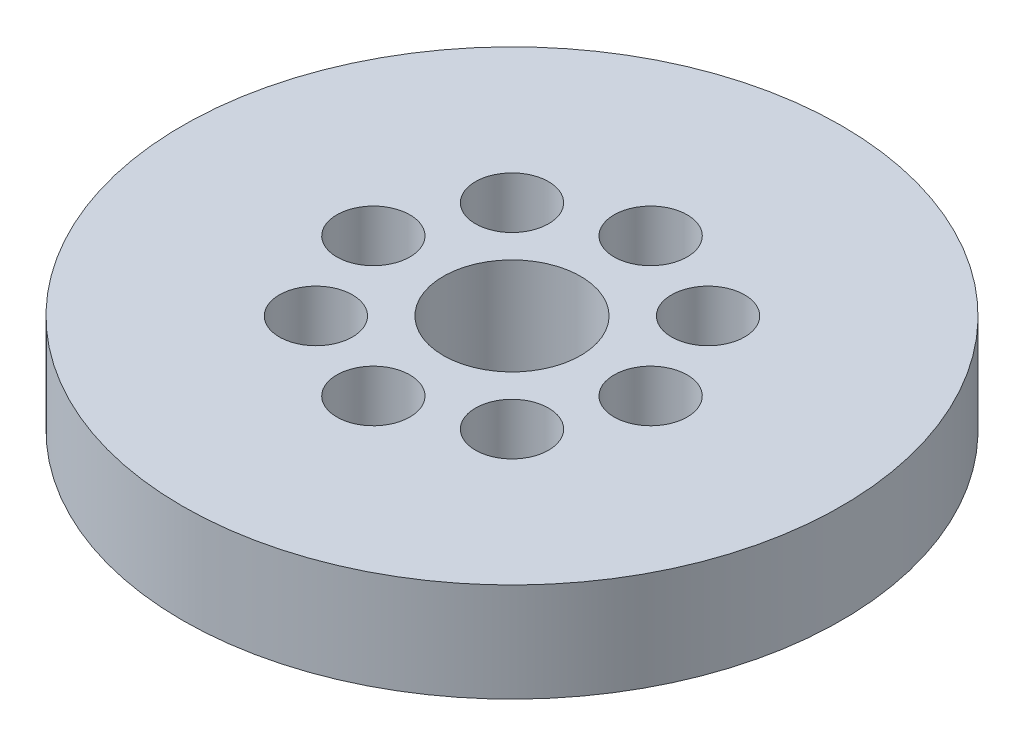
ISO-10303-21;
HEADER;
FILE_DESCRIPTION(('STEP AP214'),'2;1');
FILE_NAME('part.step','',(''),(''),'','','');
FILE_SCHEMA(('AUTOMOTIVE_DESIGN { 1 0 10303 214 1 1 1 1 }'));
ENDSEC;
DATA;
#1=APPLICATION_CONTEXT('core data for automotive mechanical design processes');
#2=APPLICATION_PROTOCOL_DEFINITION('international standard','automotive_design',2000,#1);
#3=PRODUCT_CONTEXT('',#1,'mechanical');
#4=PRODUCT('Part','Part','',(#3));
#5=PRODUCT_RELATED_PRODUCT_CATEGORY('part','',(#4));
#6=PRODUCT_DEFINITION_FORMATION('','',#4);
#7=PRODUCT_DEFINITION_CONTEXT('part definition',#1,'design');
#8=PRODUCT_DEFINITION('design','',#6,#7);
#9=PRODUCT_DEFINITION_SHAPE('','',#8);
#10=(LENGTH_UNIT() NAMED_UNIT(*) SI_UNIT(.MILLI.,.METRE.));
#11=(NAMED_UNIT(*) PLANE_ANGLE_UNIT() SI_UNIT($,.RADIAN.));
#12=(NAMED_UNIT(*) SI_UNIT($,.STERADIAN.) SOLID_ANGLE_UNIT());
#13=UNCERTAINTY_MEASURE_WITH_UNIT(LENGTH_MEASURE(1.E-05),#10,'distance_accuracy_value','');
#14=(GEOMETRIC_REPRESENTATION_CONTEXT(3) GLOBAL_UNCERTAINTY_ASSIGNED_CONTEXT((#13)) GLOBAL_UNIT_ASSIGNED_CONTEXT((#10,
#11,#12)) REPRESENTATION_CONTEXT('',''));
#15=CARTESIAN_POINT('',(0.,0.,0.));
#16=DIRECTION('',(0.,0.,1.));
#17=DIRECTION('',(1.,0.,0.));
#18=AXIS2_PLACEMENT_3D('',#15,#16,#17);
#19=CARTESIAN_POINT('',(0.,18.,0.));
#20=DIRECTION('',(0.,-1.,0.));
#21=DIRECTION('',(0.,0.,-1.));
#22=AXIS2_PLACEMENT_3D('',#19,#20,#21);
#23=CYLINDRICAL_SURFACE('',#22,60.);
#24=CARTESIAN_POINT('',(0.,18.,0.));
#25=DIRECTION('',(0.,1.,0.));
#26=DIRECTION('',(0.,0.,1.));
#27=AXIS2_PLACEMENT_3D('',#24,#25,#26);
#28=CIRCLE('',#27,60.);
#29=CARTESIAN_POINT('',(0.,18.,60.));
#30=VERTEX_POINT('',#29);
#31=EDGE_CURVE('E10',#30,#30,#28,.T.);
#32=ORIENTED_EDGE('',*,*,#31,.F.);
#33=EDGE_LOOP('',(#32));
#34=FACE_BOUND('',#33,.T.);
#35=CARTESIAN_POINT('',(0.,0.,0.));
#36=DIRECTION('',(0.,1.,0.));
#37=DIRECTION('',(0.,0.,1.));
#38=AXIS2_PLACEMENT_3D('',#35,#36,#37);
#39=CIRCLE('',#38,60.);
#40=CARTESIAN_POINT('',(0.,0.,60.));
#41=VERTEX_POINT('',#40);
#42=EDGE_CURVE('E37',#41,#41,#39,.T.);
#43=ORIENTED_EDGE('',*,*,#42,.T.);
#44=EDGE_LOOP('',(#43));
#45=FACE_BOUND('',#44,.T.);
#46=ADVANCED_FACE('F40',(#34,#45),#23,.T.);
#47=CARTESIAN_POINT('',(0.,18.,0.));
#48=DIRECTION('',(0.,1.,0.));
#49=DIRECTION('',(0.,0.,1.));
#50=AXIS2_PLACEMENT_3D('',#47,#48,#49);
#51=PLANE('',#50);
#52=CARTESIAN_POINT('',(0.,18.,25.2421052758937));
#53=DIRECTION('',(0.,1.,0.));
#54=DIRECTION('',(1.,0.,0.));
#55=AXIS2_PLACEMENT_3D('',#52,#53,#54);
#56=CIRCLE('',#55,6.65409280349945);
#57=CARTESIAN_POINT('',(6.65409280349954,18.,25.2421052758937));
#58=VERTEX_POINT('',#57);
#59=EDGE_CURVE('E88',#58,#58,#56,.T.);
#60=ORIENTED_EDGE('',*,*,#59,.F.);
#61=EDGE_LOOP('',(#60));
#62=FACE_BOUND('',#61,.T.);
#63=CARTESIAN_POINT('',(17.8488638120093,18.,17.8488638120091));
#64=DIRECTION('',(0.,1.,0.));
#65=DIRECTION('',(0.707106781186544,0.,-0.707106781186551));
#66=AXIS2_PLACEMENT_3D('',#63,#64,#65);
#67=CIRCLE('',#66,6.65409280349945);
#68=CARTESIAN_POINT('',(22.5540179560083,18.,13.14370966801));
#69=VERTEX_POINT('',#68);
#70=EDGE_CURVE('E79',#69,#69,#67,.T.);
#71=ORIENTED_EDGE('',*,*,#70,.F.);
#72=EDGE_LOOP('',(#71));
#73=FACE_BOUND('',#72,.T.);
#74=CARTESIAN_POINT('',(25.2421052758937,18.,0.));
#75=DIRECTION('',(0.,1.,0.));
#76=DIRECTION('',(0.,0.,-1.));
#77=AXIS2_PLACEMENT_3D('',#74,#75,#76);
#78=CIRCLE('',#77,6.65409280349945);
#79=CARTESIAN_POINT('',(25.2421052758937,18.,-6.65409280349945));
#80=VERTEX_POINT('',#79);
#81=EDGE_CURVE('E74',#80,#80,#78,.T.);
#82=ORIENTED_EDGE('',*,*,#81,.F.);
#83=EDGE_LOOP('',(#82));
#84=FACE_BOUND('',#83,.T.);
#85=CARTESIAN_POINT('',(17.848863812009,18.,-17.8488638120093));
#86=DIRECTION('',(0.,1.,0.));
#87=DIRECTION('',(-0.707106781186554,0.,-0.707106781186541));
#88=AXIS2_PLACEMENT_3D('',#85,#86,#87);
#89=CIRCLE('',#88,6.65409280349945);
#90=CARTESIAN_POINT('',(13.1437096680099,18.,-22.5540179560084));
#91=VERTEX_POINT('',#90);
#92=EDGE_CURVE('E70',#91,#91,#89,.T.);
#93=ORIENTED_EDGE('',*,*,#92,.F.);
#94=EDGE_LOOP('',(#93));
#95=FACE_BOUND('',#94,.T.);
#96=CARTESIAN_POINT('',(-2.6439701857169E-13,18.,-25.2421052758937));
#97=DIRECTION('',(0.,1.,0.));
#98=DIRECTION('',(-1.,0.,0.));
#99=AXIS2_PLACEMENT_3D('',#96,#97,#98);
#100=CIRCLE('',#99,6.65409280349945);
#101=CARTESIAN_POINT('',(-6.65409280349971,18.,-25.2421052758937));
#102=VERTEX_POINT('',#101);
#103=EDGE_CURVE('E100',#102,#102,#100,.T.);
#104=ORIENTED_EDGE('',*,*,#103,.F.);
#105=EDGE_LOOP('',(#104));
#106=FACE_BOUND('',#105,.T.);
#107=CARTESIAN_POINT('',(-17.8488638120094,18.,-17.848863812009));
#108=DIRECTION('',(0.,1.,0.));
#109=DIRECTION('',(-0.707106781186539,0.,0.707106781186556));
#110=AXIS2_PLACEMENT_3D('',#107,#108,#109);
#111=CIRCLE('',#110,6.65409280349945);
#112=CARTESIAN_POINT('',(-22.5540179560084,18.,-13.1437096680098));
#113=VERTEX_POINT('',#112);
#114=EDGE_CURVE('E93',#113,#113,#111,.T.);
#115=ORIENTED_EDGE('',*,*,#114,.F.);
#116=EDGE_LOOP('',(#115));
#117=FACE_BOUND('',#116,.T.);
#118=CARTESIAN_POINT('',(-17.8488638120091,18.,17.8488638120092));
#119=DIRECTION('',(0.,1.,0.));
#120=DIRECTION('',(0.707106781186549,0.,0.707106781186546));
#121=AXIS2_PLACEMENT_3D('',#118,#119,#120);
#122=CIRCLE('',#121,6.65409280349945);
#123=CARTESIAN_POINT('',(-13.1437096680101,18.,22.5540179560083));
#124=VERTEX_POINT('',#123);
#125=EDGE_CURVE('E61',#124,#124,#122,.T.);
#126=ORIENTED_EDGE('',*,*,#125,.F.);
#127=EDGE_LOOP('',(#126));
#128=FACE_BOUND('',#127,.T.);
#129=CARTESIAN_POINT('',(-25.2421052758937,18.,0.));
#130=DIRECTION('',(0.,1.,0.));
#131=DIRECTION('',(0.,0.,1.));
#132=AXIS2_PLACEMENT_3D('',#129,#130,#131);
#133=CIRCLE('',#132,6.65409280349945);
#134=CARTESIAN_POINT('',(-25.2421052758937,18.,6.65409280349945));
#135=VERTEX_POINT('',#134);
#136=EDGE_CURVE('E54',#135,#135,#133,.T.);
#137=ORIENTED_EDGE('',*,*,#136,.F.);
#138=EDGE_LOOP('',(#137));
#139=FACE_BOUND('',#138,.T.);
#140=CARTESIAN_POINT('',(0.,18.,0.));
#141=DIRECTION('',(0.,1.,0.));
#142=DIRECTION('',(0.,0.,1.));
#143=AXIS2_PLACEMENT_3D('',#140,#141,#142);
#144=CIRCLE('',#143,12.5);
#145=CARTESIAN_POINT('',(0.,18.,12.5));
#146=VERTEX_POINT('',#145);
#147=EDGE_CURVE('E50',#146,#146,#144,.T.);
#148=ORIENTED_EDGE('',*,*,#147,.F.);
#149=EDGE_LOOP('',(#148));
#150=FACE_BOUND('',#149,.T.);
#151=ORIENTED_EDGE('',*,*,#31,.T.);
#152=EDGE_LOOP('',(#151));
#153=FACE_BOUND('',#152,.T.);
#154=ADVANCED_FACE('F115',(#62,#73,#84,#95,#106,#117,#128,#139,#150,#153),#51,.T.);
#155=CARTESIAN_POINT('',(0.,0.,0.));
#156=DIRECTION('',(0.,1.,0.));
#157=DIRECTION('',(0.,0.,1.));
#158=AXIS2_PLACEMENT_3D('',#155,#156,#157);
#159=PLANE('',#158);
#160=CARTESIAN_POINT('',(0.,0.,0.));
#161=DIRECTION('',(0.,1.,0.));
#162=DIRECTION('',(0.,0.,1.));
#163=AXIS2_PLACEMENT_3D('',#160,#161,#162);
#164=CIRCLE('',#163,12.5);
#165=CARTESIAN_POINT('',(0.,0.,12.5));
#166=VERTEX_POINT('',#165);
#167=EDGE_CURVE('E47',#166,#166,#164,.T.);
#168=ORIENTED_EDGE('',*,*,#167,.T.);
#169=EDGE_LOOP('',(#168));
#170=FACE_BOUND('',#169,.T.);
#171=ORIENTED_EDGE('',*,*,#42,.F.);
#172=EDGE_LOOP('',(#171));
#173=FACE_BOUND('',#172,.T.);
#174=ADVANCED_FACE('F113',(#170,#173),#159,.F.);
#175=CARTESIAN_POINT('',(0.,18.,0.));
#176=DIRECTION('',(0.,-1.,0.));
#177=DIRECTION('',(0.,0.,-1.));
#178=AXIS2_PLACEMENT_3D('',#175,#176,#177);
#179=CYLINDRICAL_SURFACE('',#178,12.5);
#180=ORIENTED_EDGE('',*,*,#147,.T.);
#181=EDGE_LOOP('',(#180));
#182=FACE_BOUND('',#181,.T.);
#183=ORIENTED_EDGE('',*,*,#167,.F.);
#184=EDGE_LOOP('',(#183));
#185=FACE_BOUND('',#184,.T.);
#186=ADVANCED_FACE('F127',(#182,#185),#179,.F.);
#187=CARTESIAN_POINT('',(-25.2421052758937,5.5198192491017,0.));
#188=DIRECTION('',(0.,1.,0.));
#189=DIRECTION('',(0.,0.,1.));
#190=AXIS2_PLACEMENT_3D('',#187,#188,#189);
#191=CYLINDRICAL_SURFACE('',#190,6.65409280349945);
#192=CARTESIAN_POINT('',(-25.2421052758937,5.5198192491017,0.));
#193=DIRECTION('',(0.,1.,0.));
#194=DIRECTION('',(0.,0.,1.));
#195=AXIS2_PLACEMENT_3D('',#192,#193,#194);
#196=CIRCLE('',#195,6.65409280349945);
#197=CARTESIAN_POINT('',(-25.2421052758937,5.5198192491017,6.65409280349945));
#198=VERTEX_POINT('',#197);
#199=EDGE_CURVE('E55',#198,#198,#196,.T.);
#200=ORIENTED_EDGE('',*,*,#199,.F.);
#201=EDGE_LOOP('',(#200));
#202=FACE_BOUND('',#201,.T.);
#203=ORIENTED_EDGE('',*,*,#136,.T.);
#204=EDGE_LOOP('',(#203));
#205=FACE_BOUND('',#204,.T.);
#206=ADVANCED_FACE('F129',(#202,#205),#191,.F.);
#207=CARTESIAN_POINT('',(-25.2421052758937,5.5198192491017,0.));
#208=DIRECTION('',(0.,1.,0.));
#209=DIRECTION('',(0.,0.,1.));
#210=AXIS2_PLACEMENT_3D('',#207,#208,#209);
#211=PLANE('',#210);
#212=ORIENTED_EDGE('',*,*,#199,.T.);
#213=EDGE_LOOP('',(#212));
#214=FACE_BOUND('',#213,.T.);
#215=ADVANCED_FACE('F157',(#214),#211,.T.);
#216=CARTESIAN_POINT('',(-17.8488638120091,5.5198192491017,17.8488638120092));
#217=DIRECTION('',(0.,1.,0.));
#218=DIRECTION('',(0.,0.,1.));
#219=AXIS2_PLACEMENT_3D('',#216,#217,#218);
#220=CYLINDRICAL_SURFACE('',#219,6.65409280349945);
#221=CARTESIAN_POINT('',(-17.8488638120091,5.5198192491017,17.8488638120092));
#222=DIRECTION('',(0.,1.,0.));
#223=DIRECTION('',(0.707106781186549,0.,0.707106781186546));
#224=AXIS2_PLACEMENT_3D('',#221,#222,#223);
#225=CIRCLE('',#224,6.65409280349945);
#226=CARTESIAN_POINT('',(-13.1437096680101,5.5198192491017,22.5540179560083));
#227=VERTEX_POINT('',#226);
#228=EDGE_CURVE('E59',#227,#227,#225,.T.);
#229=ORIENTED_EDGE('',*,*,#228,.F.);
#230=EDGE_LOOP('',(#229));
#231=FACE_BOUND('',#230,.T.);
#232=ORIENTED_EDGE('',*,*,#125,.T.);
#233=EDGE_LOOP('',(#232));
#234=FACE_BOUND('',#233,.T.);
#235=ADVANCED_FACE('F170',(#231,#234),#220,.F.);
#236=CARTESIAN_POINT('',(-17.8488638120091,5.5198192491017,17.8488638120092));
#237=DIRECTION('',(0.,1.,0.));
#238=DIRECTION('',(0.707106781186549,0.,0.707106781186546));
#239=AXIS2_PLACEMENT_3D('',#236,#237,#238);
#240=PLANE('',#239);
#241=ORIENTED_EDGE('',*,*,#228,.T.);
#242=EDGE_LOOP('',(#241));
#243=FACE_BOUND('',#242,.T.);
#244=ADVANCED_FACE('F182',(#243),#240,.T.);
#245=CARTESIAN_POINT('',(-17.8488638120094,5.5198192491017,-17.848863812009));
#246=DIRECTION('',(0.,1.,0.));
#247=DIRECTION('',(0.,0.,1.));
#248=AXIS2_PLACEMENT_3D('',#245,#246,#247);
#249=CYLINDRICAL_SURFACE('',#248,6.65409280349945);
#250=CARTESIAN_POINT('',(-17.8488638120094,5.5198192491017,-17.848863812009));
#251=DIRECTION('',(0.,1.,0.));
#252=DIRECTION('',(-0.707106781186539,0.,0.707106781186556));
#253=AXIS2_PLACEMENT_3D('',#250,#251,#252);
#254=CIRCLE('',#253,6.65409280349945);
#255=CARTESIAN_POINT('',(-22.5540179560084,5.5198192491017,-13.1437096680098));
#256=VERTEX_POINT('',#255);
#257=EDGE_CURVE('E94',#256,#256,#254,.T.);
#258=ORIENTED_EDGE('',*,*,#257,.F.);
#259=EDGE_LOOP('',(#258));
#260=FACE_BOUND('',#259,.T.);
#261=ORIENTED_EDGE('',*,*,#114,.T.);
#262=EDGE_LOOP('',(#261));
#263=FACE_BOUND('',#262,.T.);
#264=ADVANCED_FACE('F189',(#260,#263),#249,.F.);
#265=CARTESIAN_POINT('',(-17.8488638120094,5.5198192491017,-17.848863812009));
#266=DIRECTION('',(0.,1.,0.));
#267=DIRECTION('',(-0.707106781186539,0.,0.707106781186556));
#268=AXIS2_PLACEMENT_3D('',#265,#266,#267);
#269=PLANE('',#268);
#270=ORIENTED_EDGE('',*,*,#257,.T.);
#271=EDGE_LOOP('',(#270));
#272=FACE_BOUND('',#271,.T.);
#273=ADVANCED_FACE('F107',(#272),#269,.T.);
#274=CARTESIAN_POINT('',(-2.6439701857169E-13,5.5198192491017,-25.2421052758937));
#275=DIRECTION('',(0.,1.,0.));
#276=DIRECTION('',(0.,0.,1.));
#277=AXIS2_PLACEMENT_3D('',#274,#275,#276);
#278=CYLINDRICAL_SURFACE('',#277,6.65409280349945);
#279=CARTESIAN_POINT('',(-2.6439701857169E-13,5.5198192491017,-25.2421052758937));
#280=DIRECTION('',(0.,1.,0.));
#281=DIRECTION('',(-1.,0.,0.));
#282=AXIS2_PLACEMENT_3D('',#279,#280,#281);
#283=CIRCLE('',#282,6.65409280349945);
#284=CARTESIAN_POINT('',(-6.65409280349971,5.5198192491017,-25.2421052758937));
#285=VERTEX_POINT('',#284);
#286=EDGE_CURVE('E72',#285,#285,#283,.T.);
#287=ORIENTED_EDGE('',*,*,#286,.F.);
#288=EDGE_LOOP('',(#287));
#289=FACE_BOUND('',#288,.T.);
#290=ORIENTED_EDGE('',*,*,#103,.T.);
#291=EDGE_LOOP('',(#290));
#292=FACE_BOUND('',#291,.T.);
#293=ADVANCED_FACE('F104',(#289,#292),#278,.F.);
#294=CARTESIAN_POINT('',(-2.6439701857169E-13,5.5198192491017,-25.2421052758937));
#295=DIRECTION('',(0.,1.,0.));
#296=DIRECTION('',(-1.,0.,0.));
#297=AXIS2_PLACEMENT_3D('',#294,#295,#296);
#298=PLANE('',#297);
#299=ORIENTED_EDGE('',*,*,#286,.T.);
#300=EDGE_LOOP('',(#299));
#301=FACE_BOUND('',#300,.T.);
#302=ADVANCED_FACE('F103',(#301),#298,.T.);
#303=CARTESIAN_POINT('',(17.848863812009,5.5198192491017,-17.8488638120093));
#304=DIRECTION('',(0.,1.,0.));
#305=DIRECTION('',(0.,0.,1.));
#306=AXIS2_PLACEMENT_3D('',#303,#304,#305);
#307=CYLINDRICAL_SURFACE('',#306,6.65409280349945);
#308=CARTESIAN_POINT('',(17.848863812009,5.5198192491017,-17.8488638120093));
#309=DIRECTION('',(0.,1.,0.));
#310=DIRECTION('',(-0.707106781186554,0.,-0.707106781186541));
#311=AXIS2_PLACEMENT_3D('',#308,#309,#310);
#312=CIRCLE('',#311,6.65409280349945);
#313=CARTESIAN_POINT('',(13.1437096680099,5.5198192491017,-22.5540179560084));
#314=VERTEX_POINT('',#313);
#315=EDGE_CURVE('E69',#314,#314,#312,.T.);
#316=ORIENTED_EDGE('',*,*,#315,.F.);
#317=EDGE_LOOP('',(#316));
#318=FACE_BOUND('',#317,.T.);
#319=ORIENTED_EDGE('',*,*,#92,.T.);
#320=EDGE_LOOP('',(#319));
#321=FACE_BOUND('',#320,.T.);
#322=ADVANCED_FACE('F219',(#318,#321),#307,.F.);
#323=CARTESIAN_POINT('',(17.848863812009,5.5198192491017,-17.8488638120093));
#324=DIRECTION('',(0.,1.,0.));
#325=DIRECTION('',(-0.707106781186554,0.,-0.707106781186541));
#326=AXIS2_PLACEMENT_3D('',#323,#324,#325);
#327=PLANE('',#326);
#328=ORIENTED_EDGE('',*,*,#315,.T.);
#329=EDGE_LOOP('',(#328));
#330=FACE_BOUND('',#329,.T.);
#331=ADVANCED_FACE('F227',(#330),#327,.T.);
#332=CARTESIAN_POINT('',(25.2421052758937,5.5198192491017,0.));
#333=DIRECTION('',(0.,1.,0.));
#334=DIRECTION('',(0.,0.,1.));
#335=AXIS2_PLACEMENT_3D('',#332,#333,#334);
#336=CYLINDRICAL_SURFACE('',#335,6.65409280349945);
#337=CARTESIAN_POINT('',(25.2421052758937,5.5198192491017,0.));
#338=DIRECTION('',(0.,1.,0.));
#339=DIRECTION('',(0.,0.,-1.));
#340=AXIS2_PLACEMENT_3D('',#337,#338,#339);
#341=CIRCLE('',#340,6.65409280349945);
#342=CARTESIAN_POINT('',(25.2421052758937,5.5198192491017,-6.65409280349945));
#343=VERTEX_POINT('',#342);
#344=EDGE_CURVE('E80',#343,#343,#341,.T.);
#345=ORIENTED_EDGE('',*,*,#344,.F.);
#346=EDGE_LOOP('',(#345));
#347=FACE_BOUND('',#346,.T.);
#348=ORIENTED_EDGE('',*,*,#81,.T.);
#349=EDGE_LOOP('',(#348));
#350=FACE_BOUND('',#349,.T.);
#351=ADVANCED_FACE('F240',(#347,#350),#336,.F.);
#352=CARTESIAN_POINT('',(25.2421052758937,5.5198192491017,0.));
#353=DIRECTION('',(0.,1.,0.));
#354=DIRECTION('',(0.,0.,-1.));
#355=AXIS2_PLACEMENT_3D('',#352,#353,#354);
#356=PLANE('',#355);
#357=ORIENTED_EDGE('',*,*,#344,.T.);
#358=EDGE_LOOP('',(#357));
#359=FACE_BOUND('',#358,.T.);
#360=ADVANCED_FACE('F246',(#359),#356,.T.);
#361=CARTESIAN_POINT('',(17.8488638120093,5.5198192491017,17.8488638120091));
#362=DIRECTION('',(0.,1.,0.));
#363=DIRECTION('',(0.,0.,1.));
#364=AXIS2_PLACEMENT_3D('',#361,#362,#363);
#365=CYLINDRICAL_SURFACE('',#364,6.65409280349945);
#366=CARTESIAN_POINT('',(17.8488638120093,5.5198192491017,17.8488638120091));
#367=DIRECTION('',(0.,1.,0.));
#368=DIRECTION('',(0.707106781186544,0.,-0.707106781186551));
#369=AXIS2_PLACEMENT_3D('',#366,#367,#368);
#370=CIRCLE('',#369,6.65409280349945);
#371=CARTESIAN_POINT('',(22.5540179560083,5.5198192491017,13.14370966801));
#372=VERTEX_POINT('',#371);
#373=EDGE_CURVE('E82',#372,#372,#370,.T.);
#374=ORIENTED_EDGE('',*,*,#373,.F.);
#375=EDGE_LOOP('',(#374));
#376=FACE_BOUND('',#375,.T.);
#377=ORIENTED_EDGE('',*,*,#70,.T.);
#378=EDGE_LOOP('',(#377));
#379=FACE_BOUND('',#378,.T.);
#380=ADVANCED_FACE('F254',(#376,#379),#365,.F.);
#381=CARTESIAN_POINT('',(17.8488638120093,5.5198192491017,17.8488638120091));
#382=DIRECTION('',(0.,1.,0.));
#383=DIRECTION('',(0.707106781186544,0.,-0.707106781186551));
#384=AXIS2_PLACEMENT_3D('',#381,#382,#383);
#385=PLANE('',#384);
#386=ORIENTED_EDGE('',*,*,#373,.T.);
#387=EDGE_LOOP('',(#386));
#388=FACE_BOUND('',#387,.T.);
#389=ADVANCED_FACE('F262',(#388),#385,.T.);
#390=CARTESIAN_POINT('',(0.,5.5198192491017,25.2421052758937));
#391=DIRECTION('',(0.,1.,0.));
#392=DIRECTION('',(0.,0.,1.));
#393=AXIS2_PLACEMENT_3D('',#390,#391,#392);
#394=CYLINDRICAL_SURFACE('',#393,6.65409280349945);
#395=CARTESIAN_POINT('',(0.,5.5198192491017,25.2421052758937));
#396=DIRECTION('',(0.,1.,0.));
#397=DIRECTION('',(1.,0.,0.));
#398=AXIS2_PLACEMENT_3D('',#395,#396,#397);
#399=CIRCLE('',#398,6.65409280349945);
#400=CARTESIAN_POINT('',(6.65409280349954,5.5198192491017,25.2421052758937));
#401=VERTEX_POINT('',#400);
#402=EDGE_CURVE('E63',#401,#401,#399,.T.);
#403=ORIENTED_EDGE('',*,*,#402,.F.);
#404=EDGE_LOOP('',(#403));
#405=FACE_BOUND('',#404,.T.);
#406=ORIENTED_EDGE('',*,*,#59,.T.);
#407=EDGE_LOOP('',(#406));
#408=FACE_BOUND('',#407,.T.);
#409=ADVANCED_FACE('F272',(#405,#408),#394,.F.);
#410=CARTESIAN_POINT('',(0.,5.5198192491017,25.2421052758937));
#411=DIRECTION('',(0.,1.,0.));
#412=DIRECTION('',(1.,0.,0.));
#413=AXIS2_PLACEMENT_3D('',#410,#411,#412);
#414=PLANE('',#413);
#415=ORIENTED_EDGE('',*,*,#402,.T.);
#416=EDGE_LOOP('',(#415));
#417=FACE_BOUND('',#416,.T.);
#418=ADVANCED_FACE('F285',(#417),#414,.T.);
#419=CLOSED_SHELL('',(#46,#154,#174,#186,#206,#215,#235,#244,#264,#273,#293,#302,#322,#331,#351,
#360,#380,#389,#409,#418));
#420=MANIFOLD_SOLID_BREP('B2',#419);
#421=ADVANCED_BREP_SHAPE_REPRESENTATION('',(#18,#420),#14);
#422=SHAPE_DEFINITION_REPRESENTATION(#9,#421);
ENDSEC;
END-ISO-10303-21;
